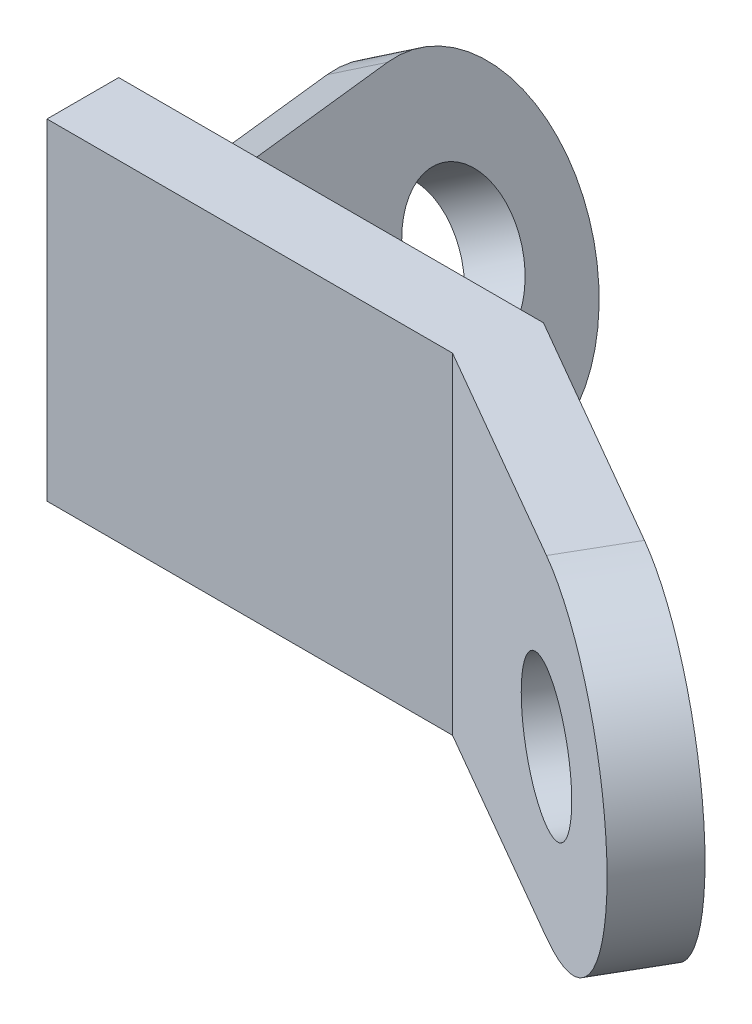
ISO-10303-21;
HEADER;
FILE_DESCRIPTION(('STEP AP214'),'2;1');
FILE_NAME('part.step','',(''),(''),'','','');
FILE_SCHEMA(('AUTOMOTIVE_DESIGN { 1 0 10303 214 1 1 1 1 }'));
ENDSEC;
DATA;
#1=APPLICATION_CONTEXT('core data for automotive mechanical design processes');
#2=APPLICATION_PROTOCOL_DEFINITION('international standard','automotive_design',2000,#1);
#3=PRODUCT_CONTEXT('',#1,'mechanical');
#4=PRODUCT('Part','Part','',(#3));
#5=PRODUCT_RELATED_PRODUCT_CATEGORY('part','',(#4));
#6=PRODUCT_DEFINITION_FORMATION('','',#4);
#7=PRODUCT_DEFINITION_CONTEXT('part definition',#1,'design');
#8=PRODUCT_DEFINITION('design','',#6,#7);
#9=PRODUCT_DEFINITION_SHAPE('','',#8);
#10=(LENGTH_UNIT() NAMED_UNIT(*) SI_UNIT(.MILLI.,.METRE.));
#11=(NAMED_UNIT(*) PLANE_ANGLE_UNIT() SI_UNIT($,.RADIAN.));
#12=(NAMED_UNIT(*) SI_UNIT($,.STERADIAN.) SOLID_ANGLE_UNIT());
#13=UNCERTAINTY_MEASURE_WITH_UNIT(LENGTH_MEASURE(1.E-05),#10,'distance_accuracy_value','');
#14=(GEOMETRIC_REPRESENTATION_CONTEXT(3) GLOBAL_UNCERTAINTY_ASSIGNED_CONTEXT((#13)) GLOBAL_UNIT_ASSIGNED_CONTEXT((#10,
#11,#12)) REPRESENTATION_CONTEXT('',''));
#15=CARTESIAN_POINT('',(0.,0.,0.));
#16=DIRECTION('',(0.,0.,1.));
#17=DIRECTION('',(1.,0.,0.));
#18=AXIS2_PLACEMENT_3D('',#15,#16,#17);
#19=CARTESIAN_POINT('',(0.,30.,-6.5));
#20=DIRECTION('',(0.,0.,1.));
#21=DIRECTION('',(1.,0.,0.));
#22=AXIS2_PLACEMENT_3D('',#19,#20,#21);
#23=PLANE('',#22);
#24=DIRECTION('',(-0.500000000000004,0.866025403784436,0.));
#25=VECTOR('',#24,1.);
#26=CARTESIAN_POINT('',(9.7842452783194,35.6489366452551,-6.5));
#27=LINE('',#26,#25);
#28=CARTESIAN_POINT('',(43.5342452783197,-22.8077781101944,-6.5));
#29=VERTEX_POINT('',#28);
#30=CARTESIAN_POINT('',(16.0342452783195,24.8236190979495,-6.5));
#31=VERTEX_POINT('',#30);
#32=EDGE_CURVE('E12',#29,#31,#27,.T.);
#33=ORIENTED_EDGE('',*,*,#32,.F.);
#34=DIRECTION('',(0.866025403784436,0.500000000000004,0.));
#35=VECTOR('',#34,1.);
#36=CARTESIAN_POINT('',(33.7500000000003,-28.4567147554495,-6.5));
#37=LINE('',#36,#35);
#38=CARTESIAN_POINT('',(52.5000000000002,-17.631397208144,-6.5));
#39=VERTEX_POINT('',#38);
#40=EDGE_CURVE('E76',#29,#39,#37,.T.);
#41=ORIENTED_EDGE('',*,*,#40,.T.);
#42=DIRECTION('',(0.500000000000004,-0.866025403784436,0.));
#43=VECTOR('',#42,1.);
#44=CARTESIAN_POINT('',(25.,30.,-6.5));
#45=LINE('',#44,#43);
#46=CARTESIAN_POINT('',(25.,30.,-6.5));
#47=VERTEX_POINT('',#46);
#48=EDGE_CURVE('E175',#47,#39,#45,.T.);
#49=ORIENTED_EDGE('',*,*,#48,.F.);
#50=DIRECTION('',(-1.,0.,0.));
#51=VECTOR('',#50,1.);
#52=CARTESIAN_POINT('',(0.,30.,-6.5));
#53=LINE('',#52,#51);
#54=CARTESIAN_POINT('',(77.,30.,-6.5));
#55=VERTEX_POINT('',#54);
#56=EDGE_CURVE('E220',#55,#47,#53,.T.);
#57=ORIENTED_EDGE('',*,*,#56,.F.);
#58=DIRECTION('',(0.,-1.,0.));
#59=VECTOR('',#58,1.);
#60=CARTESIAN_POINT('',(77.,30.,-6.5));
#61=LINE('',#60,#59);
#62=CARTESIAN_POINT('',(77.,-30.,-6.5));
#63=VERTEX_POINT('',#62);
#64=EDGE_CURVE('E243',#55,#63,#61,.T.);
#65=ORIENTED_EDGE('',*,*,#64,.T.);
#66=DIRECTION('',(-1.,0.,0.));
#67=VECTOR('',#66,1.);
#68=CARTESIAN_POINT('',(0.,-30.,-6.5));
#69=LINE('',#68,#67);
#70=CARTESIAN_POINT('',(0.,-30.,-6.5));
#71=VERTEX_POINT('',#70);
#72=EDGE_CURVE('E209',#63,#71,#69,.T.);
#73=ORIENTED_EDGE('',*,*,#72,.T.);
#74=DIRECTION('',(0.,-1.,0.));
#75=VECTOR('',#74,1.);
#76=CARTESIAN_POINT('',(0.,30.,-6.5));
#77=LINE('',#76,#75);
#78=CARTESIAN_POINT('',(0.,30.,-6.5));
#79=VERTEX_POINT('',#78);
#80=EDGE_CURVE('E224',#79,#71,#77,.T.);
#81=ORIENTED_EDGE('',*,*,#80,.F.);
#82=EDGE_CURVE('E219',#47,#79,#53,.T.);
#83=ORIENTED_EDGE('',*,*,#82,.F.);
#84=DIRECTION('',(-0.866025403784436,-0.500000000000004,0.));
#85=VECTOR('',#84,1.);
#86=CARTESIAN_POINT('',(6.2500000000001,19.1746824526945,-6.5));
#87=LINE('',#86,#85);
#88=EDGE_CURVE('E185',#47,#31,#87,.T.);
#89=ORIENTED_EDGE('',*,*,#88,.T.);
#90=EDGE_LOOP('',(#33,#41,#49,#57,#65,#73,#81,#83,#89));
#91=FACE_BOUND('',#90,.T.);
#92=ADVANCED_FACE('F67',(#91),#23,.F.);
#93=CARTESIAN_POINT('',(73.5166604983954,30.,6.5));
#94=DIRECTION('',(0.500000000000001,0.,-0.866025403784438));
#95=DIRECTION('',(-0.866025403784438,0.,-0.500000000000001));
#96=AXIS2_PLACEMENT_3D('',#93,#94,#95);
#97=PLANE('',#96);
#98=CARTESIAN_POINT('',(113.801270189222,0.,29.7583302491978));
#99=DIRECTION('',(0.500000000000001,0.,-0.866025403784438));
#100=DIRECTION('',(-0.866025403784438,0.,-0.500000000000001));
#101=AXIS2_PLACEMENT_3D('',#98,#99,#100);
#102=CIRCLE('',#101,12.5);
#103=CARTESIAN_POINT('',(102.975952641916,0.,23.5083302491978));
#104=VERTEX_POINT('',#103);
#105=EDGE_CURVE('E199',#104,#104,#102,.T.);
#106=ORIENTED_EDGE('',*,*,#105,.T.);
#107=EDGE_LOOP('',(#106));
#108=FACE_BOUND('',#107,.T.);
#109=DIRECTION('',(0.866025403784438,0.,0.500000000000001));
#110=VECTOR('',#109,1.);
#111=CARTESIAN_POINT('',(73.5166604983954,-30.,6.5));
#112=LINE('',#111,#110);
#113=CARTESIAN_POINT('',(73.5166604983954,-30.,6.5));
#114=VERTEX_POINT('',#113);
#115=CARTESIAN_POINT('',(113.801270189222,-30.,29.7583302491978));
#116=VERTEX_POINT('',#115);
#117=EDGE_CURVE('E231',#114,#116,#112,.T.);
#118=ORIENTED_EDGE('',*,*,#117,.T.);
#119=CARTESIAN_POINT('',(113.801270189222,0.,29.7583302491978));
#120=DIRECTION('',(0.500000000000001,0.,-0.866025403784438));
#121=DIRECTION('',(-0.866025403784438,0.,-0.500000000000001));
#122=AXIS2_PLACEMENT_3D('',#119,#120,#121);
#123=CIRCLE('',#122,30.);
#124=CARTESIAN_POINT('',(113.801270189222,30.,29.7583302491978));
#125=VERTEX_POINT('',#124);
#126=EDGE_CURVE('E196',#125,#116,#123,.T.);
#127=ORIENTED_EDGE('',*,*,#126,.F.);
#128=DIRECTION('',(0.866025403784438,0.,0.500000000000001));
#129=VECTOR('',#128,1.);
#130=CARTESIAN_POINT('',(73.5166604983954,30.,6.5));
#131=LINE('',#130,#129);
#132=CARTESIAN_POINT('',(73.5166604983954,30.,6.5));
#133=VERTEX_POINT('',#132);
#134=EDGE_CURVE('E212',#133,#125,#131,.T.);
#135=ORIENTED_EDGE('',*,*,#134,.F.);
#136=DIRECTION('',(0.,-1.,0.));
#137=VECTOR('',#136,1.);
#138=CARTESIAN_POINT('',(73.5166604983954,30.,6.5));
#139=LINE('',#138,#137);
#140=EDGE_CURVE('E247',#133,#114,#139,.T.);
#141=ORIENTED_EDGE('',*,*,#140,.T.);
#142=EDGE_LOOP('',(#118,#127,#135,#141));
#143=FACE_BOUND('',#142,.T.);
#144=ADVANCED_FACE('F293',(#108,#143),#97,.F.);
#145=CARTESIAN_POINT('',(77.,30.,-6.5));
#146=DIRECTION('',(-0.500000000000001,0.,0.866025403784438));
#147=DIRECTION('',(0.866025403784438,0.,0.500000000000001));
#148=AXIS2_PLACEMENT_3D('',#145,#146,#147);
#149=PLANE('',#148);
#150=CARTESIAN_POINT('',(120.301270189222,0.,18.5));
#151=DIRECTION('',(0.5,0.,-0.866025403784439));
#152=DIRECTION('',(-0.866025403784439,0.,-0.5));
#153=AXIS2_PLACEMENT_3D('',#150,#151,#152);
#154=CIRCLE('',#153,12.5);
#155=CARTESIAN_POINT('',(109.475952641917,0.,12.25));
#156=VERTEX_POINT('',#155);
#157=EDGE_CURVE('E192',#156,#156,#154,.T.);
#158=ORIENTED_EDGE('',*,*,#157,.F.);
#159=EDGE_LOOP('',(#158));
#160=FACE_BOUND('',#159,.T.);
#161=CARTESIAN_POINT('',(120.301270189222,0.,18.5));
#162=DIRECTION('',(0.5,0.,-0.866025403784439));
#163=DIRECTION('',(-0.866025403784439,0.,-0.5));
#164=AXIS2_PLACEMENT_3D('',#161,#162,#163);
#165=CIRCLE('',#164,30.);
#166=CARTESIAN_POINT('',(120.301270189222,30.,18.5000000000001));
#167=VERTEX_POINT('',#166);
#168=CARTESIAN_POINT('',(120.301270189222,-30.,18.5));
#169=VERTEX_POINT('',#168);
#170=EDGE_CURVE('E91',#167,#169,#165,.T.);
#171=ORIENTED_EDGE('',*,*,#170,.T.);
#172=DIRECTION('',(-0.866025403784438,0.,-0.500000000000001));
#173=VECTOR('',#172,1.);
#174=CARTESIAN_POINT('',(77.,-30.,-6.5));
#175=LINE('',#174,#173);
#176=EDGE_CURVE('E235',#169,#63,#175,.T.);
#177=ORIENTED_EDGE('',*,*,#176,.T.);
#178=ORIENTED_EDGE('',*,*,#64,.F.);
#179=DIRECTION('',(-0.866025403784438,0.,-0.500000000000001));
#180=VECTOR('',#179,1.);
#181=CARTESIAN_POINT('',(77.,30.,-6.5));
#182=LINE('',#181,#180);
#183=EDGE_CURVE('E216',#167,#55,#182,.T.);
#184=ORIENTED_EDGE('',*,*,#183,.F.);
#185=EDGE_LOOP('',(#171,#177,#178,#184));
#186=FACE_BOUND('',#185,.T.);
#187=ADVANCED_FACE('F298',(#160,#186),#149,.F.);
#188=CARTESIAN_POINT('',(0.,30.,6.5));
#189=DIRECTION('',(1.,0.,0.));
#190=DIRECTION('',(0.,0.,-1.));
#191=AXIS2_PLACEMENT_3D('',#188,#189,#190);
#192=PLANE('',#191);
#193=DIRECTION('',(0.,0.,1.));
#194=VECTOR('',#193,1.);
#195=CARTESIAN_POINT('',(0.,-30.,6.5));
#196=LINE('',#195,#194);
#197=CARTESIAN_POINT('',(0.,-30.,6.5));
#198=VERTEX_POINT('',#197);
#199=EDGE_CURVE('E203',#71,#198,#196,.T.);
#200=ORIENTED_EDGE('',*,*,#199,.T.);
#201=DIRECTION('',(0.,-1.,0.));
#202=VECTOR('',#201,1.);
#203=CARTESIAN_POINT('',(0.,30.,6.5));
#204=LINE('',#203,#202);
#205=CARTESIAN_POINT('',(0.,30.,6.5));
#206=VERTEX_POINT('',#205);
#207=EDGE_CURVE('E251',#206,#198,#204,.T.);
#208=ORIENTED_EDGE('',*,*,#207,.F.);
#209=DIRECTION('',(0.,0.,1.));
#210=VECTOR('',#209,1.);
#211=CARTESIAN_POINT('',(0.,30.,6.5));
#212=LINE('',#211,#210);
#213=EDGE_CURVE('E204',#79,#206,#212,.T.);
#214=ORIENTED_EDGE('',*,*,#213,.F.);
#215=ORIENTED_EDGE('',*,*,#80,.T.);
#216=EDGE_LOOP('',(#200,#208,#214,#215));
#217=FACE_BOUND('',#216,.T.);
#218=ADVANCED_FACE('F69',(#217),#192,.F.);
#219=CARTESIAN_POINT('',(0.,30.,6.5));
#220=DIRECTION('',(0.,0.,-1.));
#221=DIRECTION('',(-1.,0.,0.));
#222=AXIS2_PLACEMENT_3D('',#219,#220,#221);
#223=PLANE('',#222);
#224=DIRECTION('',(1.,0.,0.));
#225=VECTOR('',#224,1.);
#226=CARTESIAN_POINT('',(0.,-30.,6.5));
#227=LINE('',#226,#225);
#228=EDGE_CURVE('E228',#198,#114,#227,.T.);
#229=ORIENTED_EDGE('',*,*,#228,.T.);
#230=ORIENTED_EDGE('',*,*,#140,.F.);
#231=DIRECTION('',(1.,0.,0.));
#232=VECTOR('',#231,1.);
#233=CARTESIAN_POINT('',(0.,30.,6.5));
#234=LINE('',#233,#232);
#235=EDGE_CURVE('E208',#206,#133,#234,.T.);
#236=ORIENTED_EDGE('',*,*,#235,.F.);
#237=ORIENTED_EDGE('',*,*,#207,.T.);
#238=EDGE_LOOP('',(#229,#230,#236,#237));
#239=FACE_BOUND('',#238,.T.);
#240=ADVANCED_FACE('F307',(#239),#223,.F.);
#241=CARTESIAN_POINT('',(0.,30.,0.));
#242=DIRECTION('',(0.,-1.,0.));
#243=DIRECTION('',(0.,0.,-1.));
#244=AXIS2_PLACEMENT_3D('',#241,#242,#243);
#245=PLANE('',#244);
#246=ORIENTED_EDGE('',*,*,#134,.T.);
#247=DIRECTION('',(0.5,0.,-0.866025403784439));
#248=VECTOR('',#247,1.);
#249=CARTESIAN_POINT('',(90.301270189222,30.,70.4615242270663));
#250=LINE('',#249,#248);
#251=EDGE_CURVE('E255',#125,#167,#250,.T.);
#252=ORIENTED_EDGE('',*,*,#251,.T.);
#253=ORIENTED_EDGE('',*,*,#183,.T.);
#254=ORIENTED_EDGE('',*,*,#56,.T.);
#255=ORIENTED_EDGE('',*,*,#82,.T.);
#256=ORIENTED_EDGE('',*,*,#213,.T.);
#257=ORIENTED_EDGE('',*,*,#235,.T.);
#258=EDGE_LOOP('',(#246,#252,#253,#254,#255,#256,#257));
#259=FACE_BOUND('',#258,.T.);
#260=ADVANCED_FACE('F309',(#259),#245,.F.);
#261=CARTESIAN_POINT('',(0.,-30.,0.));
#262=DIRECTION('',(0.,-1.,0.));
#263=DIRECTION('',(0.,0.,-1.));
#264=AXIS2_PLACEMENT_3D('',#261,#262,#263);
#265=PLANE('',#264);
#266=DIRECTION('',(0.5,0.,-0.866025403784439));
#267=VECTOR('',#266,1.);
#268=CARTESIAN_POINT('',(90.301270189222,-30.,70.4615242270663));
#269=LINE('',#268,#267);
#270=EDGE_CURVE('E258',#116,#169,#269,.T.);
#271=ORIENTED_EDGE('',*,*,#270,.F.);
#272=ORIENTED_EDGE('',*,*,#117,.F.);
#273=ORIENTED_EDGE('',*,*,#228,.F.);
#274=ORIENTED_EDGE('',*,*,#199,.F.);
#275=ORIENTED_EDGE('',*,*,#72,.F.);
#276=ORIENTED_EDGE('',*,*,#176,.F.);
#277=EDGE_LOOP('',(#271,#272,#273,#274,#275,#276));
#278=FACE_BOUND('',#277,.T.);
#279=ADVANCED_FACE('F303',(#278),#265,.T.);
#280=CARTESIAN_POINT('',(90.301270189222,0.,70.4615242270663));
#281=DIRECTION('',(0.5,0.,-0.866025403784439));
#282=DIRECTION('',(-0.866025403784439,0.,-0.5));
#283=AXIS2_PLACEMENT_3D('',#280,#281,#282);
#284=CYLINDRICAL_SURFACE('',#283,30.);
#285=ORIENTED_EDGE('',*,*,#126,.T.);
#286=ORIENTED_EDGE('',*,*,#270,.T.);
#287=ORIENTED_EDGE('',*,*,#170,.F.);
#288=ORIENTED_EDGE('',*,*,#251,.F.);
#289=EDGE_LOOP('',(#285,#286,#287,#288));
#290=FACE_BOUND('',#289,.T.);
#291=ADVANCED_FACE('F328',(#290),#284,.T.);
#292=CARTESIAN_POINT('',(90.301270189222,0.,70.4615242270663));
#293=DIRECTION('',(0.5,0.,-0.866025403784439));
#294=DIRECTION('',(-0.866025403784439,0.,-0.5));
#295=AXIS2_PLACEMENT_3D('',#292,#293,#294);
#296=CYLINDRICAL_SURFACE('',#295,12.5);
#297=ORIENTED_EDGE('',*,*,#157,.T.);
#298=EDGE_LOOP('',(#297));
#299=FACE_BOUND('',#298,.T.);
#300=ORIENTED_EDGE('',*,*,#105,.F.);
#301=EDGE_LOOP('',(#300));
#302=FACE_BOUND('',#301,.T.);
#303=ADVANCED_FACE('F336',(#299,#302),#296,.F.);
#304=CARTESIAN_POINT('',(44.1348369626222,-22.4610263395894,-3.91180954897482));
#305=DIRECTION('',(0.500000000000004,-0.866025403784436,0.));
#306=DIRECTION('',(0.866025403784436,0.500000000000004,0.));
#307=AXIS2_PLACEMENT_3D('',#304,#305,#306);
#308=PLANE('',#307);
#309=ORIENTED_EDGE('',*,*,#40,.F.);
#310=DIRECTION('',(-0.22414386804201,-0.12940952255126,-0.965925826289069));
#311=VECTOR('',#310,1.);
#312=CARTESIAN_POINT('',(44.1348369626222,-22.4610263395894,-3.91180954897482));
#313=LINE('',#312,#311);
#314=CARTESIAN_POINT('',(36.9622331852778,-26.6021310612297,-34.821435990225));
#315=VERTEX_POINT('',#314);
#316=EDGE_CURVE('E145',#29,#315,#313,.T.);
#317=ORIENTED_EDGE('',*,*,#316,.T.);
#318=DIRECTION('',(0.836516303737806,0.482962913144539,-0.258819045102518));
#319=VECTOR('',#318,1.);
#320=CARTESIAN_POINT('',(36.9622331852778,-26.6021310612297,-34.821435990225));
#321=LINE('',#320,#319);
#322=CARTESIAN_POINT('',(45.3273962226559,-21.7725019297843,-37.4096264412502));
#323=VERTEX_POINT('',#322);
#324=EDGE_CURVE('E148',#315,#323,#321,.T.);
#325=ORIENTED_EDGE('',*,*,#324,.T.);
#326=DIRECTION('',(-0.22414386804201,-0.12940952255126,-0.965925826289069));
#327=VECTOR('',#326,1.);
#328=CARTESIAN_POINT('',(52.5000000000002,-17.631397208144,-6.5));
#329=LINE('',#328,#327);
#330=EDGE_CURVE('E179',#39,#323,#329,.T.);
#331=ORIENTED_EDGE('',*,*,#330,.F.);
#332=EDGE_LOOP('',(#309,#317,#325,#331));
#333=FACE_BOUND('',#332,.T.);
#334=ADVANCED_FACE('F147',(#333),#308,.T.);
#335=CARTESIAN_POINT('',(23.2122331852777,-2.7864324571577,-34.821435990225));
#336=DIRECTION('',(0.836516303737806,0.482962913144538,-0.258819045102518));
#337=DIRECTION('',(-0.500000000000004,0.866025403784436,0.));
#338=AXIS2_PLACEMENT_3D('',#335,#336,#337);
#339=PLANE('',#338);
#340=CARTESIAN_POINT('',(23.2122331852777,-2.7864324571577,-34.821435990225));
#341=DIRECTION('',(0.836516303737806,0.482962913144538,-0.258819045102518));
#342=DIRECTION('',(-0.500000000000004,0.866025403784436,0.));
#343=AXIS2_PLACEMENT_3D('',#340,#341,#342);
#344=CIRCLE('',#343,12.5);
#345=CARTESIAN_POINT('',(16.9622331852777,8.03888509014776,-34.821435990225));
#346=VERTEX_POINT('',#345);
#347=EDGE_CURVE('E176',#346,#346,#344,.T.);
#348=ORIENTED_EDGE('',*,*,#347,.T.);
#349=EDGE_LOOP('',(#348));
#350=FACE_BOUND('',#349,.T.);
#351=ORIENTED_EDGE('',*,*,#316,.F.);
#352=ORIENTED_EDGE('',*,*,#32,.T.);
#353=DIRECTION('',(0.22414386804201,0.12940952255126,0.965925826289069));
#354=VECTOR('',#353,1.);
#355=CARTESIAN_POINT('',(16.6348369626219,25.1703708685546,-3.91180954897482));
#356=LINE('',#355,#354);
#357=CARTESIAN_POINT('',(9.46223318527762,21.0292661469143,-34.821435990225));
#358=VERTEX_POINT('',#357);
#359=EDGE_CURVE('E156',#358,#31,#356,.T.);
#360=ORIENTED_EDGE('',*,*,#359,.F.);
#361=CARTESIAN_POINT('',(23.2122331852777,-2.7864324571577,-34.821435990225));
#362=DIRECTION('',(0.836516303737806,0.482962913144538,-0.258819045102518));
#363=DIRECTION('',(-0.500000000000004,0.866025403784436,0.));
#364=AXIS2_PLACEMENT_3D('',#361,#362,#363);
#365=CIRCLE('',#364,27.5);
#366=EDGE_CURVE('E155',#315,#358,#365,.T.);
#367=ORIENTED_EDGE('',*,*,#366,.F.);
#368=EDGE_LOOP('',(#351,#352,#360,#367));
#369=FACE_BOUND('',#368,.T.);
#370=ADVANCED_FACE('F167',(#350,#369),#339,.F.);
#371=CARTESIAN_POINT('',(16.6348369626219,25.1703708685546,-3.91180954897482));
#372=DIRECTION('',(-0.500000000000004,0.866025403784436,0.));
#373=DIRECTION('',(-0.866025403784436,-0.500000000000004,0.));
#374=AXIS2_PLACEMENT_3D('',#371,#372,#373);
#375=PLANE('',#374);
#376=ORIENTED_EDGE('',*,*,#88,.F.);
#377=DIRECTION('',(0.22414386804201,0.12940952255126,0.965925826289069));
#378=VECTOR('',#377,1.);
#379=CARTESIAN_POINT('',(25.,30.,-6.5));
#380=LINE('',#379,#378);
#381=CARTESIAN_POINT('',(17.8273962226557,25.8588952783597,-37.4096264412502));
#382=VERTEX_POINT('',#381);
#383=EDGE_CURVE('E83',#382,#47,#380,.T.);
#384=ORIENTED_EDGE('',*,*,#383,.F.);
#385=DIRECTION('',(0.836516303737806,0.482962913144539,-0.258819045102518));
#386=VECTOR('',#385,1.);
#387=CARTESIAN_POINT('',(9.46223318527762,21.0292661469143,-34.821435990225));
#388=LINE('',#387,#386);
#389=EDGE_CURVE('E164',#358,#382,#388,.T.);
#390=ORIENTED_EDGE('',*,*,#389,.F.);
#391=ORIENTED_EDGE('',*,*,#359,.T.);
#392=EDGE_LOOP('',(#376,#384,#390,#391));
#393=FACE_BOUND('',#392,.T.);
#394=ADVANCED_FACE('F266',(#393),#375,.T.);
#395=CARTESIAN_POINT('',(23.2122331852777,-2.7864324571577,-34.821435990225));
#396=DIRECTION('',(0.836516303737806,0.482962913144539,-0.258819045102518));
#397=DIRECTION('',(-0.500000000000004,0.866025403784436,0.));
#398=AXIS2_PLACEMENT_3D('',#395,#396,#397);
#399=CYLINDRICAL_SURFACE('',#398,27.5);
#400=CARTESIAN_POINT('',(31.5773962226558,2.04319667428769,-37.4096264412502));
#401=DIRECTION('',(0.836516303737806,0.482962913144538,-0.258819045102518));
#402=DIRECTION('',(-0.500000000000004,0.866025403784436,0.));
#403=AXIS2_PLACEMENT_3D('',#400,#401,#402);
#404=CIRCLE('',#403,27.5);
#405=EDGE_CURVE('E162',#323,#382,#404,.T.);
#406=ORIENTED_EDGE('',*,*,#405,.F.);
#407=ORIENTED_EDGE('',*,*,#324,.F.);
#408=ORIENTED_EDGE('',*,*,#366,.T.);
#409=ORIENTED_EDGE('',*,*,#389,.T.);
#410=EDGE_LOOP('',(#406,#407,#408,#409));
#411=FACE_BOUND('',#410,.T.);
#412=ADVANCED_FACE('F161',(#411),#399,.T.);
#413=CARTESIAN_POINT('',(31.5773962226558,2.04319667428769,-37.4096264412502));
#414=DIRECTION('',(0.836516303737806,0.482962913144538,-0.258819045102518));
#415=DIRECTION('',(-0.500000000000004,0.866025403784436,0.));
#416=AXIS2_PLACEMENT_3D('',#413,#414,#415);
#417=PLANE('',#416);
#418=CARTESIAN_POINT('',(31.5773962226558,2.04319667428769,-37.4096264412502));
#419=DIRECTION('',(0.836516303737806,0.482962913144538,-0.258819045102518));
#420=DIRECTION('',(-0.500000000000004,0.866025403784436,0.));
#421=AXIS2_PLACEMENT_3D('',#418,#419,#420);
#422=CIRCLE('',#421,12.5);
#423=CARTESIAN_POINT('',(25.3273962226557,12.8685142215931,-37.4096264412502));
#424=VERTEX_POINT('',#423);
#425=EDGE_CURVE('E269',#424,#424,#422,.T.);
#426=ORIENTED_EDGE('',*,*,#425,.F.);
#427=EDGE_LOOP('',(#426));
#428=FACE_BOUND('',#427,.T.);
#429=ORIENTED_EDGE('',*,*,#383,.T.);
#430=ORIENTED_EDGE('',*,*,#48,.T.);
#431=ORIENTED_EDGE('',*,*,#330,.T.);
#432=ORIENTED_EDGE('',*,*,#405,.T.);
#433=EDGE_LOOP('',(#429,#430,#431,#432));
#434=FACE_BOUND('',#433,.T.);
#435=ADVANCED_FACE('F281',(#428,#434),#417,.T.);
#436=CARTESIAN_POINT('',(23.2122331852777,-2.7864324571577,-34.821435990225));
#437=DIRECTION('',(0.836516303737806,0.482962913144539,-0.258819045102518));
#438=DIRECTION('',(-0.500000000000004,0.866025403784436,0.));
#439=AXIS2_PLACEMENT_3D('',#436,#437,#438);
#440=CYLINDRICAL_SURFACE('',#439,12.5);
#441=ORIENTED_EDGE('',*,*,#347,.F.);
#442=EDGE_LOOP('',(#441));
#443=FACE_BOUND('',#442,.T.);
#444=ORIENTED_EDGE('',*,*,#425,.T.);
#445=EDGE_LOOP('',(#444));
#446=FACE_BOUND('',#445,.T.);
#447=ADVANCED_FACE('F278',(#443,#446),#440,.F.);
#448=CLOSED_SHELL('',(#92,#144,#187,#218,#240,#260,#279,#291,#303,#334,#370,#394,#412,#435,#447));
#449=MANIFOLD_SOLID_BREP('B2',#448);
#450=ADVANCED_BREP_SHAPE_REPRESENTATION('',(#18,#449),#14);
#451=SHAPE_DEFINITION_REPRESENTATION(#9,#450);
ENDSEC;
END-ISO-10303-21;
